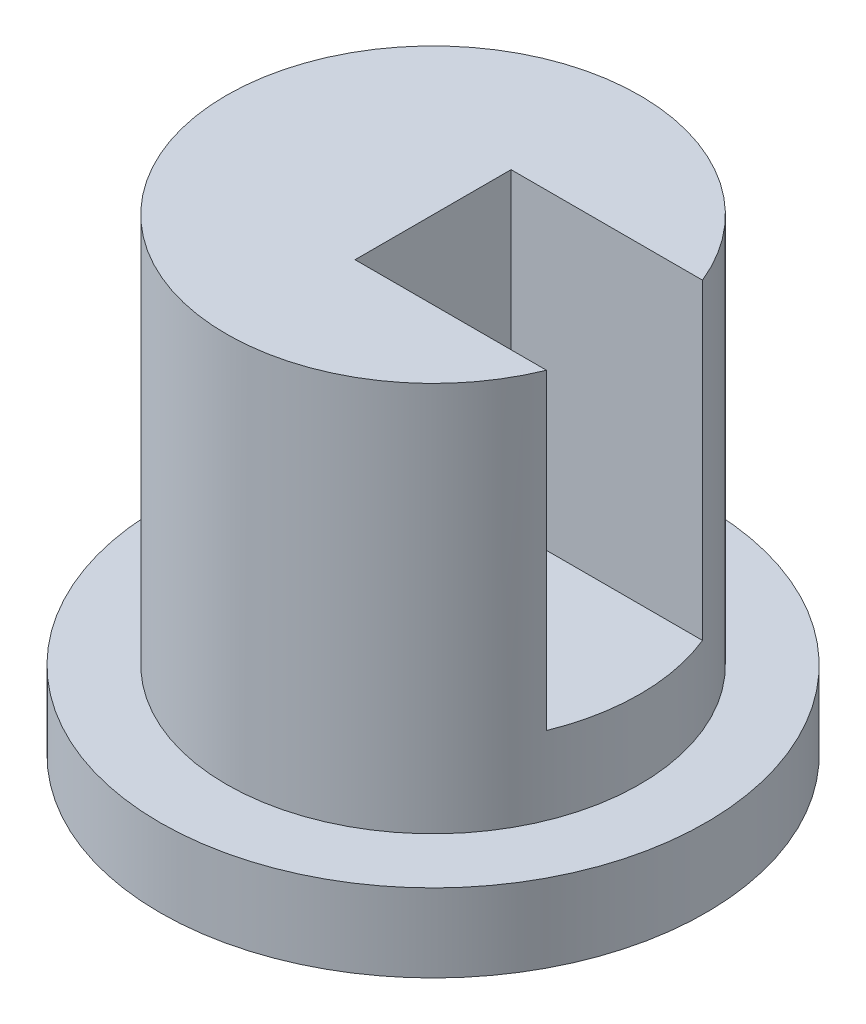
ISO-10303-21;
HEADER;
FILE_DESCRIPTION(('STEP AP214'),'2;1');
FILE_NAME('part.step','',(''),(''),'','','');
FILE_SCHEMA(('AUTOMOTIVE_DESIGN { 1 0 10303 214 1 1 1 1 }'));
ENDSEC;
DATA;
#1=APPLICATION_CONTEXT('core data for automotive mechanical design processes');
#2=APPLICATION_PROTOCOL_DEFINITION('international standard','automotive_design',2000,#1);
#3=PRODUCT_CONTEXT('',#1,'mechanical');
#4=PRODUCT('Part','Part','',(#3));
#5=PRODUCT_RELATED_PRODUCT_CATEGORY('part','',(#4));
#6=PRODUCT_DEFINITION_FORMATION('','',#4);
#7=PRODUCT_DEFINITION_CONTEXT('part definition',#1,'design');
#8=PRODUCT_DEFINITION('design','',#6,#7);
#9=PRODUCT_DEFINITION_SHAPE('','',#8);
#10=(LENGTH_UNIT() NAMED_UNIT(*) SI_UNIT(.MILLI.,.METRE.));
#11=(NAMED_UNIT(*) PLANE_ANGLE_UNIT() SI_UNIT($,.RADIAN.));
#12=(NAMED_UNIT(*) SI_UNIT($,.STERADIAN.) SOLID_ANGLE_UNIT());
#13=UNCERTAINTY_MEASURE_WITH_UNIT(LENGTH_MEASURE(1.E-05),#10,'distance_accuracy_value','');
#14=(GEOMETRIC_REPRESENTATION_CONTEXT(3) GLOBAL_UNCERTAINTY_ASSIGNED_CONTEXT((#13)) GLOBAL_UNIT_ASSIGNED_CONTEXT((#10,
#11,#12)) REPRESENTATION_CONTEXT('',''));
#15=CARTESIAN_POINT('',(0.,0.,0.));
#16=DIRECTION('',(0.,0.,1.));
#17=DIRECTION('',(1.,0.,0.));
#18=AXIS2_PLACEMENT_3D('',#15,#16,#17);
#19=CARTESIAN_POINT('',(0.,60.,0.));
#20=DIRECTION('',(0.,-1.,0.));
#21=DIRECTION('',(0.,0.,-1.));
#22=AXIS2_PLACEMENT_3D('',#19,#20,#21);
#23=CYLINDRICAL_SURFACE('',#22,26.5);
#24=CARTESIAN_POINT('',(0.,10.,0.));
#25=DIRECTION('',(0.,1.,0.));
#26=DIRECTION('',(0.,0.,1.));
#27=AXIS2_PLACEMENT_3D('',#24,#25,#26);
#28=CIRCLE('',#27,26.5);
#29=CARTESIAN_POINT('',(0.,10.,26.5));
#30=VERTEX_POINT('',#29);
#31=EDGE_CURVE('E117',#30,#30,#28,.T.);
#32=ORIENTED_EDGE('',*,*,#31,.T.);
#33=EDGE_LOOP('',(#32));
#34=FACE_BOUND('',#33,.T.);
#35=DIRECTION('',(0.,-1.,0.));
#36=VECTOR('',#35,1.);
#37=CARTESIAN_POINT('',(24.5407823836161,60.,9.99999999999999));
#38=LINE('',#37,#36);
#39=CARTESIAN_POINT('',(24.5407823836161,60.,9.99999999999999));
#40=VERTEX_POINT('',#39);
#41=CARTESIAN_POINT('',(24.5407823836161,20.,10.));
#42=VERTEX_POINT('',#41);
#43=EDGE_CURVE('E84',#40,#42,#38,.T.);
#44=ORIENTED_EDGE('',*,*,#43,.F.);
#45=CARTESIAN_POINT('',(0.,60.,0.));
#46=DIRECTION('',(0.,1.,0.));
#47=DIRECTION('',(0.,0.,1.));
#48=AXIS2_PLACEMENT_3D('',#45,#46,#47);
#49=CIRCLE('',#48,26.5);
#50=CARTESIAN_POINT('',(24.5407823836161,60.,-9.99999999999999));
#51=VERTEX_POINT('',#50);
#52=EDGE_CURVE('E112',#51,#40,#49,.T.);
#53=ORIENTED_EDGE('',*,*,#52,.F.);
#54=DIRECTION('',(0.,-1.,0.));
#55=VECTOR('',#54,1.);
#56=CARTESIAN_POINT('',(24.5407823836161,60.,-9.99999999999999));
#57=LINE('',#56,#55);
#58=CARTESIAN_POINT('',(24.5407823836161,20.,-10.));
#59=VERTEX_POINT('',#58);
#60=EDGE_CURVE('E88',#59,#51,#57,.F.);
#61=ORIENTED_EDGE('',*,*,#60,.F.);
#62=CARTESIAN_POINT('',(0.,20.,0.));
#63=DIRECTION('',(0.,1.,0.));
#64=DIRECTION('',(0.,0.,1.));
#65=AXIS2_PLACEMENT_3D('',#62,#63,#64);
#66=CIRCLE('',#65,26.5);
#67=EDGE_CURVE('E11',#42,#59,#66,.T.);
#68=ORIENTED_EDGE('',*,*,#67,.F.);
#69=EDGE_LOOP('',(#44,#53,#61,#68));
#70=FACE_BOUND('',#69,.T.);
#71=ADVANCED_FACE('F39',(#34,#70),#23,.T.);
#72=CARTESIAN_POINT('',(0.,60.,0.));
#73=DIRECTION('',(0.,1.,0.));
#74=DIRECTION('',(0.,0.,1.));
#75=AXIS2_PLACEMENT_3D('',#72,#73,#74);
#76=PLANE('',#75);
#77=ORIENTED_EDGE('',*,*,#52,.T.);
#78=DIRECTION('',(-1.,0.,0.));
#79=VECTOR('',#78,1.);
#80=CARTESIAN_POINT('',(0.,60.,9.99999999999999));
#81=LINE('',#80,#79);
#82=CARTESIAN_POINT('',(0.,60.,9.99999999999999));
#83=VERTEX_POINT('',#82);
#84=EDGE_CURVE('E48',#40,#83,#81,.T.);
#85=ORIENTED_EDGE('',*,*,#84,.T.);
#86=DIRECTION('',(0.,0.,1.));
#87=VECTOR('',#86,1.);
#88=CARTESIAN_POINT('',(0.,60.,9.99999999999999));
#89=LINE('',#88,#87);
#90=CARTESIAN_POINT('',(0.,60.,-10.));
#91=VERTEX_POINT('',#90);
#92=EDGE_CURVE('E98',#91,#83,#89,.T.);
#93=ORIENTED_EDGE('',*,*,#92,.F.);
#94=DIRECTION('',(1.,0.,0.));
#95=VECTOR('',#94,1.);
#96=CARTESIAN_POINT('',(0.,60.,-9.99999999999999));
#97=LINE('',#96,#95);
#98=EDGE_CURVE('E121',#91,#51,#97,.T.);
#99=ORIENTED_EDGE('',*,*,#98,.T.);
#100=EDGE_LOOP('',(#77,#85,#93,#99));
#101=FACE_BOUND('',#100,.T.);
#102=ADVANCED_FACE('F133',(#101),#76,.T.);
#103=CARTESIAN_POINT('',(0.,10.,0.));
#104=DIRECTION('',(0.,-1.,0.));
#105=DIRECTION('',(0.,0.,-1.));
#106=AXIS2_PLACEMENT_3D('',#103,#104,#105);
#107=CYLINDRICAL_SURFACE('',#106,35.);
#108=CARTESIAN_POINT('',(0.,10.,0.));
#109=DIRECTION('',(0.,1.,0.));
#110=DIRECTION('',(0.,0.,1.));
#111=AXIS2_PLACEMENT_3D('',#108,#109,#110);
#112=CIRCLE('',#111,35.);
#113=CARTESIAN_POINT('',(0.,10.,35.));
#114=VERTEX_POINT('',#113);
#115=EDGE_CURVE('E122',#114,#114,#112,.T.);
#116=ORIENTED_EDGE('',*,*,#115,.F.);
#117=EDGE_LOOP('',(#116));
#118=FACE_BOUND('',#117,.T.);
#119=CARTESIAN_POINT('',(0.,0.,0.));
#120=DIRECTION('',(0.,1.,0.));
#121=DIRECTION('',(0.,0.,1.));
#122=AXIS2_PLACEMENT_3D('',#119,#120,#121);
#123=CIRCLE('',#122,35.);
#124=CARTESIAN_POINT('',(0.,0.,35.));
#125=VERTEX_POINT('',#124);
#126=EDGE_CURVE('E116',#125,#125,#123,.T.);
#127=ORIENTED_EDGE('',*,*,#126,.T.);
#128=EDGE_LOOP('',(#127));
#129=FACE_BOUND('',#128,.T.);
#130=ADVANCED_FACE('F41',(#118,#129),#107,.T.);
#131=CARTESIAN_POINT('',(0.,10.,0.));
#132=DIRECTION('',(0.,1.,0.));
#133=DIRECTION('',(0.,0.,1.));
#134=AXIS2_PLACEMENT_3D('',#131,#132,#133);
#135=PLANE('',#134);
#136=ORIENTED_EDGE('',*,*,#31,.F.);
#137=EDGE_LOOP('',(#136));
#138=FACE_BOUND('',#137,.T.);
#139=ORIENTED_EDGE('',*,*,#115,.T.);
#140=EDGE_LOOP('',(#139));
#141=FACE_BOUND('',#140,.T.);
#142=ADVANCED_FACE('F156',(#138,#141),#135,.T.);
#143=CARTESIAN_POINT('',(0.,0.,0.));
#144=DIRECTION('',(0.,1.,0.));
#145=DIRECTION('',(0.,0.,1.));
#146=AXIS2_PLACEMENT_3D('',#143,#144,#145);
#147=PLANE('',#146);
#148=ORIENTED_EDGE('',*,*,#126,.F.);
#149=EDGE_LOOP('',(#148));
#150=FACE_BOUND('',#149,.T.);
#151=ADVANCED_FACE('F158',(#150),#147,.F.);
#152=CARTESIAN_POINT('',(40.,20.,10.));
#153=DIRECTION('',(0.,1.,0.));
#154=DIRECTION('',(0.,0.,1.));
#155=AXIS2_PLACEMENT_3D('',#152,#153,#154);
#156=PLANE('',#155);
#157=ORIENTED_EDGE('',*,*,#67,.T.);
#158=DIRECTION('',(-1.,0.,0.));
#159=VECTOR('',#158,1.);
#160=CARTESIAN_POINT('',(40.,20.,-10.));
#161=LINE('',#160,#159);
#162=CARTESIAN_POINT('',(0.,20.,-10.));
#163=VERTEX_POINT('',#162);
#164=EDGE_CURVE('E89',#59,#163,#161,.T.);
#165=ORIENTED_EDGE('',*,*,#164,.T.);
#166=DIRECTION('',(0.,0.,-1.));
#167=VECTOR('',#166,1.);
#168=CARTESIAN_POINT('',(0.,20.,10.));
#169=LINE('',#168,#167);
#170=CARTESIAN_POINT('',(0.,20.,10.));
#171=VERTEX_POINT('',#170);
#172=EDGE_CURVE('E91',#171,#163,#169,.T.);
#173=ORIENTED_EDGE('',*,*,#172,.F.);
#174=DIRECTION('',(-1.,0.,0.));
#175=VECTOR('',#174,1.);
#176=CARTESIAN_POINT('',(40.,20.,10.));
#177=LINE('',#176,#175);
#178=EDGE_CURVE('E79',#42,#171,#177,.T.);
#179=ORIENTED_EDGE('',*,*,#178,.F.);
#180=EDGE_LOOP('',(#157,#165,#173,#179));
#181=FACE_BOUND('',#180,.T.);
#182=ADVANCED_FACE('F92',(#181),#156,.T.);
#183=CARTESIAN_POINT('',(40.,60.,9.99999999999999));
#184=DIRECTION('',(0.,0.,-1.));
#185=DIRECTION('',(0.,1.,0.));
#186=AXIS2_PLACEMENT_3D('',#183,#184,#185);
#187=PLANE('',#186);
#188=ORIENTED_EDGE('',*,*,#43,.T.);
#189=ORIENTED_EDGE('',*,*,#178,.T.);
#190=DIRECTION('',(0.,-1.,0.));
#191=VECTOR('',#190,1.);
#192=CARTESIAN_POINT('',(0.,60.,9.99999999999999));
#193=LINE('',#192,#191);
#194=EDGE_CURVE('E83',#83,#171,#193,.T.);
#195=ORIENTED_EDGE('',*,*,#194,.F.);
#196=ORIENTED_EDGE('',*,*,#84,.F.);
#197=EDGE_LOOP('',(#188,#189,#195,#196));
#198=FACE_BOUND('',#197,.T.);
#199=ADVANCED_FACE('F81',(#198),#187,.T.);
#200=CARTESIAN_POINT('',(40.,60.,-9.99999999999999));
#201=DIRECTION('',(0.,0.,1.));
#202=DIRECTION('',(0.,-1.,0.));
#203=AXIS2_PLACEMENT_3D('',#200,#201,#202);
#204=PLANE('',#203);
#205=ORIENTED_EDGE('',*,*,#60,.T.);
#206=ORIENTED_EDGE('',*,*,#98,.F.);
#207=DIRECTION('',(0.,1.,0.));
#208=VECTOR('',#207,1.);
#209=CARTESIAN_POINT('',(0.,60.,-9.99999999999999));
#210=LINE('',#209,#208);
#211=EDGE_CURVE('E55',#163,#91,#210,.T.);
#212=ORIENTED_EDGE('',*,*,#211,.F.);
#213=ORIENTED_EDGE('',*,*,#164,.F.);
#214=EDGE_LOOP('',(#205,#206,#212,#213));
#215=FACE_BOUND('',#214,.T.);
#216=ADVANCED_FACE('F138',(#215),#204,.T.);
#217=CARTESIAN_POINT('',(0.,0.,0.));
#218=DIRECTION('',(1.,0.,0.));
#219=DIRECTION('',(0.,0.,-1.));
#220=AXIS2_PLACEMENT_3D('',#217,#218,#219);
#221=PLANE('',#220);
#222=ORIENTED_EDGE('',*,*,#194,.T.);
#223=ORIENTED_EDGE('',*,*,#172,.T.);
#224=ORIENTED_EDGE('',*,*,#211,.T.);
#225=ORIENTED_EDGE('',*,*,#92,.T.);
#226=EDGE_LOOP('',(#222,#223,#224,#225));
#227=FACE_BOUND('',#226,.T.);
#228=ADVANCED_FACE('F96',(#227),#221,.T.);
#229=CLOSED_SHELL('',(#71,#102,#130,#142,#151,#182,#199,#216,#228));
#230=MANIFOLD_SOLID_BREP('B2',#229);
#231=ADVANCED_BREP_SHAPE_REPRESENTATION('',(#18,#230),#14);
#232=SHAPE_DEFINITION_REPRESENTATION(#9,#231);
ENDSEC;
END-ISO-10303-21;
